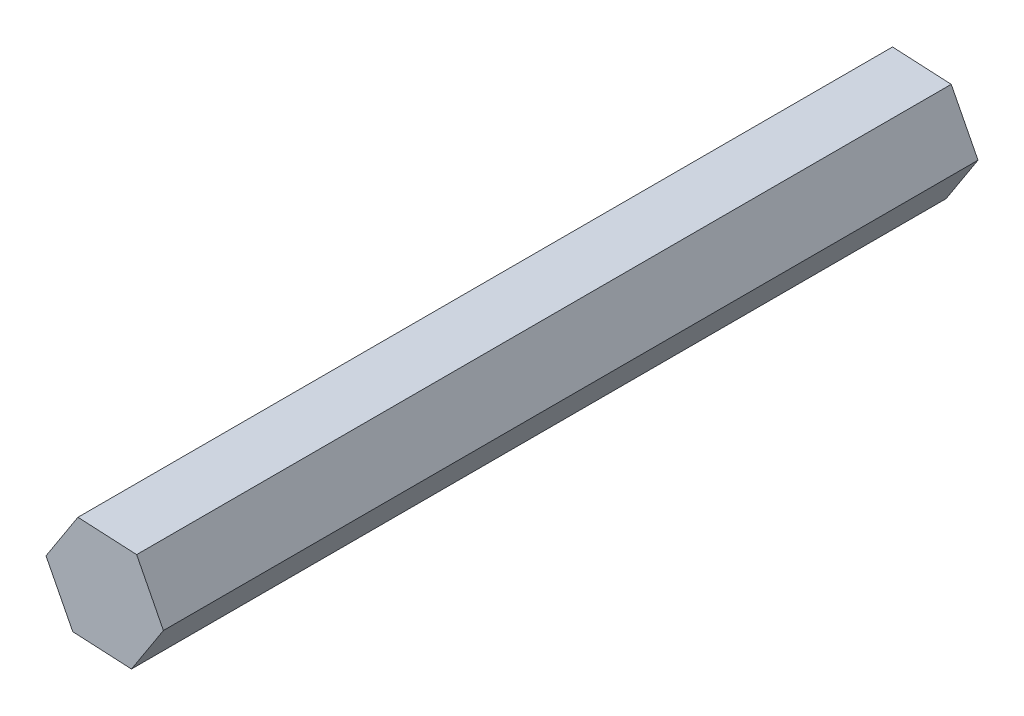
ISO-10303-21;
HEADER;
FILE_DESCRIPTION(('STEP AP214'),'2;1');
FILE_NAME('part.step','',(''),(''),'','','');
FILE_SCHEMA(('AUTOMOTIVE_DESIGN { 1 0 10303 214 1 1 1 1 }'));
ENDSEC;
DATA;
#1=APPLICATION_CONTEXT('core data for automotive mechanical design processes');
#2=APPLICATION_PROTOCOL_DEFINITION('international standard','automotive_design',2000,#1);
#3=PRODUCT_CONTEXT('',#1,'mechanical');
#4=PRODUCT('Part','Part','',(#3));
#5=PRODUCT_RELATED_PRODUCT_CATEGORY('part','',(#4));
#6=PRODUCT_DEFINITION_FORMATION('','',#4);
#7=PRODUCT_DEFINITION_CONTEXT('part definition',#1,'design');
#8=PRODUCT_DEFINITION('design','',#6,#7);
#9=PRODUCT_DEFINITION_SHAPE('','',#8);
#10=(LENGTH_UNIT() NAMED_UNIT(*) SI_UNIT(.MILLI.,.METRE.));
#11=(NAMED_UNIT(*) PLANE_ANGLE_UNIT() SI_UNIT($,.RADIAN.));
#12=(NAMED_UNIT(*) SI_UNIT($,.STERADIAN.) SOLID_ANGLE_UNIT());
#13=UNCERTAINTY_MEASURE_WITH_UNIT(LENGTH_MEASURE(1.E-05),#10,'distance_accuracy_value','');
#14=(GEOMETRIC_REPRESENTATION_CONTEXT(3) GLOBAL_UNCERTAINTY_ASSIGNED_CONTEXT((#13)) GLOBAL_UNIT_ASSIGNED_CONTEXT((#10,
#11,#12)) REPRESENTATION_CONTEXT('',''));
#15=CARTESIAN_POINT('',(0.,0.,0.));
#16=DIRECTION('',(0.,0.,1.));
#17=DIRECTION('',(1.,0.,0.));
#18=AXIS2_PLACEMENT_3D('',#15,#16,#17);
#19=CARTESIAN_POINT('',(7.32284974499151,-0.373101789879124,101.6));
#20=DIRECTION('',(-0.890345688639372,-0.455285135625227,0.));
#21=DIRECTION('',(0.455285135625227,-0.890345688639372,0.));
#22=AXIS2_PLACEMENT_3D('',#19,#20,#21);
#23=PLANE('',#22);
#24=DIRECTION('',(-0.455285135625227,0.890345688639372,0.));
#25=VECTOR('',#24,1.);
#26=CARTESIAN_POINT('',(7.32284974499151,-0.373101789879124,0.));
#27=LINE('',#26,#25);
#28=CARTESIAN_POINT('',(7.32284974499151,-0.373101789879124,0.));
#29=VERTEX_POINT('',#28);
#30=CARTESIAN_POINT('',(3.9845405007285,6.1552230123195,0.));
#31=VERTEX_POINT('',#30);
#32=EDGE_CURVE('E117',#29,#31,#27,.T.);
#33=ORIENTED_EDGE('',*,*,#32,.T.);
#34=DIRECTION('',(0.,0.,-1.));
#35=VECTOR('',#34,1.);
#36=CARTESIAN_POINT('',(3.9845405007285,6.1552230123195,101.6));
#37=LINE('',#36,#35);
#38=CARTESIAN_POINT('',(3.9845405007285,6.1552230123195,101.6));
#39=VERTEX_POINT('',#38);
#40=EDGE_CURVE('E11',#39,#31,#37,.T.);
#41=ORIENTED_EDGE('',*,*,#40,.F.);
#42=DIRECTION('',(-0.455285135625227,0.890345688639372,0.));
#43=VECTOR('',#42,1.);
#44=CARTESIAN_POINT('',(7.32284974499151,-0.373101789879124,101.6));
#45=LINE('',#44,#43);
#46=CARTESIAN_POINT('',(7.32284974499151,-0.373101789879124,101.6));
#47=VERTEX_POINT('',#46);
#48=EDGE_CURVE('E127',#47,#39,#45,.T.);
#49=ORIENTED_EDGE('',*,*,#48,.F.);
#50=DIRECTION('',(0.,0.,-1.));
#51=VECTOR('',#50,1.);
#52=CARTESIAN_POINT('',(7.32284974499151,-0.373101789879124,101.6));
#53=LINE('',#52,#51);
#54=EDGE_CURVE('E113',#47,#29,#53,.T.);
#55=ORIENTED_EDGE('',*,*,#54,.T.);
#56=EDGE_LOOP('',(#33,#41,#49,#55));
#57=FACE_BOUND('',#56,.T.);
#58=ADVANCED_FACE('F33',(#57),#23,.F.);
#59=CARTESIAN_POINT('',(3.9845405007285,6.1552230123195,101.6));
#60=DIRECTION('',(-0.0508843509027964,-0.99870455232426,0.));
#61=DIRECTION('',(0.99870455232426,-0.0508843509027964,0.));
#62=AXIS2_PLACEMENT_3D('',#59,#60,#61);
#63=PLANE('',#62);
#64=DIRECTION('',(-0.99870455232426,0.0508843509027964,0.));
#65=VECTOR('',#64,1.);
#66=CARTESIAN_POINT('',(3.9845405007285,6.1552230123195,0.));
#67=LINE('',#66,#65);
#68=CARTESIAN_POINT('',(-3.33830924426301,6.52832480219861,0.));
#69=VERTEX_POINT('',#68);
#70=EDGE_CURVE('E120',#31,#69,#67,.T.);
#71=ORIENTED_EDGE('',*,*,#70,.T.);
#72=DIRECTION('',(0.,0.,-1.));
#73=VECTOR('',#72,1.);
#74=CARTESIAN_POINT('',(-3.33830924426301,6.52832480219861,101.6));
#75=LINE('',#74,#73);
#76=CARTESIAN_POINT('',(-3.33830924426301,6.52832480219861,101.6));
#77=VERTEX_POINT('',#76);
#78=EDGE_CURVE('E41',#77,#69,#75,.T.);
#79=ORIENTED_EDGE('',*,*,#78,.F.);
#80=DIRECTION('',(-0.99870455232426,0.0508843509027964,0.));
#81=VECTOR('',#80,1.);
#82=CARTESIAN_POINT('',(3.9845405007285,6.1552230123195,101.6));
#83=LINE('',#82,#81);
#84=EDGE_CURVE('E86',#39,#77,#83,.T.);
#85=ORIENTED_EDGE('',*,*,#84,.F.);
#86=ORIENTED_EDGE('',*,*,#40,.T.);
#87=EDGE_LOOP('',(#71,#79,#85,#86));
#88=FACE_BOUND('',#87,.T.);
#89=ADVANCED_FACE('F151',(#88),#63,.F.);
#90=CARTESIAN_POINT('',(-3.33830924426301,6.52832480219861,101.6));
#91=DIRECTION('',(0.839461337736576,-0.543419416699033,0.));
#92=DIRECTION('',(0.543419416699033,0.839461337736576,0.));
#93=AXIS2_PLACEMENT_3D('',#90,#91,#92);
#94=PLANE('',#93);
#95=DIRECTION('',(-0.543419416699033,-0.839461337736576,0.));
#96=VECTOR('',#95,1.);
#97=CARTESIAN_POINT('',(-3.33830924426301,6.52832480219861,0.));
#98=LINE('',#97,#96);
#99=CARTESIAN_POINT('',(-7.32284974499153,0.373101789879118,0.));
#100=VERTEX_POINT('',#99);
#101=EDGE_CURVE('E122',#69,#100,#98,.T.);
#102=ORIENTED_EDGE('',*,*,#101,.T.);
#103=DIRECTION('',(0.,0.,-1.));
#104=VECTOR('',#103,1.);
#105=CARTESIAN_POINT('',(-7.32284974499153,0.373101789879118,101.6));
#106=LINE('',#105,#104);
#107=CARTESIAN_POINT('',(-7.32284974499153,0.373101789879118,101.6));
#108=VERTEX_POINT('',#107);
#109=EDGE_CURVE('E108',#108,#100,#106,.T.);
#110=ORIENTED_EDGE('',*,*,#109,.F.);
#111=DIRECTION('',(-0.543419416699033,-0.839461337736576,0.));
#112=VECTOR('',#111,1.);
#113=CARTESIAN_POINT('',(-3.33830924426301,6.52832480219861,101.6));
#114=LINE('',#113,#112);
#115=EDGE_CURVE('E99',#77,#108,#114,.T.);
#116=ORIENTED_EDGE('',*,*,#115,.F.);
#117=ORIENTED_EDGE('',*,*,#78,.T.);
#118=EDGE_LOOP('',(#102,#110,#116,#117));
#119=FACE_BOUND('',#118,.T.);
#120=ADVANCED_FACE('F133',(#119),#94,.F.);
#121=CARTESIAN_POINT('',(-7.32284974499153,0.373101789879118,101.6));
#122=DIRECTION('',(0.890345688639372,0.455285135625228,0.));
#123=DIRECTION('',(-0.455285135625228,0.890345688639372,0.));
#124=AXIS2_PLACEMENT_3D('',#121,#122,#123);
#125=PLANE('',#124);
#126=DIRECTION('',(0.455285135625228,-0.890345688639372,0.));
#127=VECTOR('',#126,1.);
#128=CARTESIAN_POINT('',(-7.32284974499153,0.373101789879118,0.));
#129=LINE('',#128,#127);
#130=CARTESIAN_POINT('',(-3.98454050072851,-6.1552230123195,0.));
#131=VERTEX_POINT('',#130);
#132=EDGE_CURVE('E107',#100,#131,#129,.T.);
#133=ORIENTED_EDGE('',*,*,#132,.T.);
#134=DIRECTION('',(0.,0.,-1.));
#135=VECTOR('',#134,1.);
#136=CARTESIAN_POINT('',(-3.98454050072851,-6.1552230123195,101.6));
#137=LINE('',#136,#135);
#138=CARTESIAN_POINT('',(-3.98454050072851,-6.1552230123195,101.6));
#139=VERTEX_POINT('',#138);
#140=EDGE_CURVE('E104',#139,#131,#137,.T.);
#141=ORIENTED_EDGE('',*,*,#140,.F.);
#142=DIRECTION('',(0.455285135625228,-0.890345688639372,0.));
#143=VECTOR('',#142,1.);
#144=CARTESIAN_POINT('',(-7.32284974499153,0.373101789879118,101.6));
#145=LINE('',#144,#143);
#146=EDGE_CURVE('E93',#108,#139,#145,.T.);
#147=ORIENTED_EDGE('',*,*,#146,.F.);
#148=ORIENTED_EDGE('',*,*,#109,.T.);
#149=EDGE_LOOP('',(#133,#141,#147,#148));
#150=FACE_BOUND('',#149,.T.);
#151=ADVANCED_FACE('F105',(#150),#125,.F.);
#152=CARTESIAN_POINT('',(-3.98454050072851,-6.1552230123195,101.6));
#153=DIRECTION('',(0.0508843509027953,0.99870455232426,0.));
#154=DIRECTION('',(-0.99870455232426,0.0508843509027953,0.));
#155=AXIS2_PLACEMENT_3D('',#152,#153,#154);
#156=PLANE('',#155);
#157=DIRECTION('',(0.99870455232426,-0.0508843509027953,0.));
#158=VECTOR('',#157,1.);
#159=CARTESIAN_POINT('',(-3.98454050072851,-6.1552230123195,0.));
#160=LINE('',#159,#158);
#161=CARTESIAN_POINT('',(3.33830924426301,-6.5283248021986,0.));
#162=VERTEX_POINT('',#161);
#163=EDGE_CURVE('E72',#131,#162,#160,.T.);
#164=ORIENTED_EDGE('',*,*,#163,.T.);
#165=DIRECTION('',(0.,0.,-1.));
#166=VECTOR('',#165,1.);
#167=CARTESIAN_POINT('',(3.33830924426301,-6.5283248021986,101.6));
#168=LINE('',#167,#166);
#169=CARTESIAN_POINT('',(3.33830924426301,-6.5283248021986,101.6));
#170=VERTEX_POINT('',#169);
#171=EDGE_CURVE('E109',#170,#162,#168,.T.);
#172=ORIENTED_EDGE('',*,*,#171,.F.);
#173=DIRECTION('',(0.99870455232426,-0.0508843509027953,0.));
#174=VECTOR('',#173,1.);
#175=CARTESIAN_POINT('',(-3.98454050072851,-6.1552230123195,101.6));
#176=LINE('',#175,#174);
#177=EDGE_CURVE('E97',#139,#170,#176,.T.);
#178=ORIENTED_EDGE('',*,*,#177,.F.);
#179=ORIENTED_EDGE('',*,*,#140,.T.);
#180=EDGE_LOOP('',(#164,#172,#178,#179));
#181=FACE_BOUND('',#180,.T.);
#182=ADVANCED_FACE('F111',(#181),#156,.F.);
#183=CARTESIAN_POINT('',(3.33830924426301,-6.5283248021986,101.6));
#184=DIRECTION('',(-0.839461337736576,0.543419416699033,0.));
#185=DIRECTION('',(-0.543419416699033,-0.839461337736577,0.));
#186=AXIS2_PLACEMENT_3D('',#183,#184,#185);
#187=PLANE('',#186);
#188=DIRECTION('',(0.543419416699033,0.839461337736576,0.));
#189=VECTOR('',#188,1.);
#190=CARTESIAN_POINT('',(3.33830924426301,-6.5283248021986,0.));
#191=LINE('',#190,#189);
#192=EDGE_CURVE('E78',#162,#29,#191,.T.);
#193=ORIENTED_EDGE('',*,*,#192,.T.);
#194=ORIENTED_EDGE('',*,*,#54,.F.);
#195=DIRECTION('',(0.543419416699033,0.839461337736576,0.));
#196=VECTOR('',#195,1.);
#197=CARTESIAN_POINT('',(3.33830924426301,-6.5283248021986,101.6));
#198=LINE('',#197,#196);
#199=EDGE_CURVE('E49',#170,#47,#198,.T.);
#200=ORIENTED_EDGE('',*,*,#199,.F.);
#201=ORIENTED_EDGE('',*,*,#171,.T.);
#202=EDGE_LOOP('',(#193,#194,#200,#201));
#203=FACE_BOUND('',#202,.T.);
#204=ADVANCED_FACE('F140',(#203),#187,.F.);
#205=CARTESIAN_POINT('',(0.,0.,101.6));
#206=DIRECTION('',(0.,0.,1.));
#207=DIRECTION('',(1.,0.,0.));
#208=AXIS2_PLACEMENT_3D('',#205,#206,#207);
#209=PLANE('',#208);
#210=ORIENTED_EDGE('',*,*,#48,.T.);
#211=ORIENTED_EDGE('',*,*,#84,.T.);
#212=ORIENTED_EDGE('',*,*,#115,.T.);
#213=ORIENTED_EDGE('',*,*,#146,.T.);
#214=ORIENTED_EDGE('',*,*,#177,.T.);
#215=ORIENTED_EDGE('',*,*,#199,.T.);
#216=EDGE_LOOP('',(#210,#211,#212,#213,#214,#215));
#217=FACE_BOUND('',#216,.T.);
#218=ADVANCED_FACE('F95',(#217),#209,.T.);
#219=CARTESIAN_POINT('',(0.,0.,0.));
#220=DIRECTION('',(0.,0.,1.));
#221=DIRECTION('',(1.,0.,0.));
#222=AXIS2_PLACEMENT_3D('',#219,#220,#221);
#223=PLANE('',#222);
#224=ORIENTED_EDGE('',*,*,#32,.F.);
#225=ORIENTED_EDGE('',*,*,#192,.F.);
#226=ORIENTED_EDGE('',*,*,#163,.F.);
#227=ORIENTED_EDGE('',*,*,#132,.F.);
#228=ORIENTED_EDGE('',*,*,#101,.F.);
#229=ORIENTED_EDGE('',*,*,#70,.F.);
#230=EDGE_LOOP('',(#224,#225,#226,#227,#228,#229));
#231=FACE_BOUND('',#230,.T.);
#232=ADVANCED_FACE('F136',(#231),#223,.F.);
#233=CLOSED_SHELL('',(#58,#89,#120,#151,#182,#204,#218,#232));
#234=MANIFOLD_SOLID_BREP('B2',#233);
#235=ADVANCED_BREP_SHAPE_REPRESENTATION('',(#18,#234),#14);
#236=SHAPE_DEFINITION_REPRESENTATION(#9,#235);
ENDSEC;
END-ISO-10303-21;
